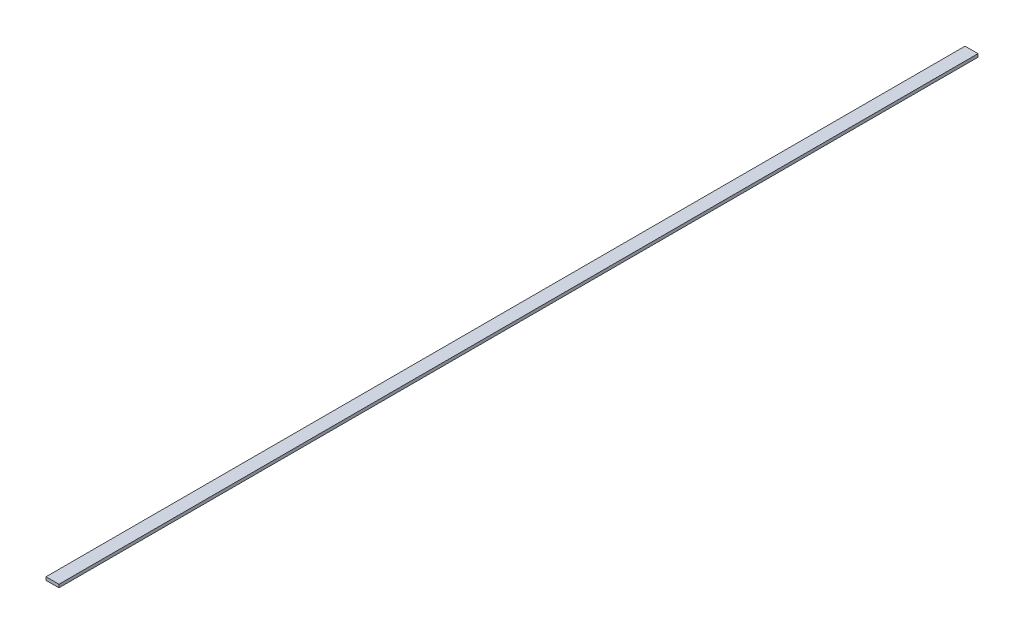
ISO-10303-21;
HEADER;
FILE_DESCRIPTION(('STEP AP214'),'2;1');
FILE_NAME('part.step','',(''),(''),'','','');
FILE_SCHEMA(('AUTOMOTIVE_DESIGN { 1 0 10303 214 1 1 1 1 }'));
ENDSEC;
DATA;
#1=APPLICATION_CONTEXT('core data for automotive mechanical design processes');
#2=APPLICATION_PROTOCOL_DEFINITION('international standard','automotive_design',2000,#1);
#3=PRODUCT_CONTEXT('',#1,'mechanical');
#4=PRODUCT('Part','Part','',(#3));
#5=PRODUCT_RELATED_PRODUCT_CATEGORY('part','',(#4));
#6=PRODUCT_DEFINITION_FORMATION('','',#4);
#7=PRODUCT_DEFINITION_CONTEXT('part definition',#1,'design');
#8=PRODUCT_DEFINITION('design','',#6,#7);
#9=PRODUCT_DEFINITION_SHAPE('','',#8);
#10=(LENGTH_UNIT() NAMED_UNIT(*) SI_UNIT(.MILLI.,.METRE.));
#11=(NAMED_UNIT(*) PLANE_ANGLE_UNIT() SI_UNIT($,.RADIAN.));
#12=(NAMED_UNIT(*) SI_UNIT($,.STERADIAN.) SOLID_ANGLE_UNIT());
#13=UNCERTAINTY_MEASURE_WITH_UNIT(LENGTH_MEASURE(1.E-05),#10,'distance_accuracy_value','');
#14=(GEOMETRIC_REPRESENTATION_CONTEXT(3) GLOBAL_UNCERTAINTY_ASSIGNED_CONTEXT((#13)) GLOBAL_UNIT_ASSIGNED_CONTEXT((#10,
#11,#12)) REPRESENTATION_CONTEXT('',''));
#15=CARTESIAN_POINT('',(0.,0.,0.));
#16=DIRECTION('',(0.,0.,1.));
#17=DIRECTION('',(1.,0.,0.));
#18=AXIS2_PLACEMENT_3D('',#15,#16,#17);
#19=CARTESIAN_POINT('',(0.,1.5,0.));
#20=DIRECTION('',(1.,0.,0.));
#21=DIRECTION('',(0.,0.,-1.));
#22=AXIS2_PLACEMENT_3D('',#19,#20,#21);
#23=PLANE('',#22);
#24=DIRECTION('',(0.,0.,1.));
#25=VECTOR('',#24,1.);
#26=CARTESIAN_POINT('',(0.,0.,0.));
#27=LINE('',#26,#25);
#28=CARTESIAN_POINT('',(0.,0.,-440.));
#29=VERTEX_POINT('',#28);
#30=CARTESIAN_POINT('',(0.,0.,0.));
#31=VERTEX_POINT('',#30);
#32=EDGE_CURVE('E96',#29,#31,#27,.T.);
#33=ORIENTED_EDGE('',*,*,#32,.T.);
#34=DIRECTION('',(0.,-1.,0.));
#35=VECTOR('',#34,1.);
#36=CARTESIAN_POINT('',(0.,1.5,0.));
#37=LINE('',#36,#35);
#38=CARTESIAN_POINT('',(0.,1.5,0.));
#39=VERTEX_POINT('',#38);
#40=EDGE_CURVE('E11',#39,#31,#37,.T.);
#41=ORIENTED_EDGE('',*,*,#40,.F.);
#42=DIRECTION('',(0.,0.,1.));
#43=VECTOR('',#42,1.);
#44=CARTESIAN_POINT('',(0.,1.5,0.));
#45=LINE('',#44,#43);
#46=CARTESIAN_POINT('',(0.,1.5,-440.));
#47=VERTEX_POINT('',#46);
#48=EDGE_CURVE('E84',#47,#39,#45,.T.);
#49=ORIENTED_EDGE('',*,*,#48,.F.);
#50=DIRECTION('',(0.,-1.,0.));
#51=VECTOR('',#50,1.);
#52=CARTESIAN_POINT('',(0.,1.5,-440.));
#53=LINE('',#52,#51);
#54=EDGE_CURVE('E92',#47,#29,#53,.T.);
#55=ORIENTED_EDGE('',*,*,#54,.T.);
#56=EDGE_LOOP('',(#33,#41,#49,#55));
#57=FACE_BOUND('',#56,.T.);
#58=ADVANCED_FACE('F33',(#57),#23,.F.);
#59=CARTESIAN_POINT('',(0.,1.5,0.));
#60=DIRECTION('',(0.,0.,-1.));
#61=DIRECTION('',(-1.,0.,0.));
#62=AXIS2_PLACEMENT_3D('',#59,#60,#61);
#63=PLANE('',#62);
#64=DIRECTION('',(1.,0.,0.));
#65=VECTOR('',#64,1.);
#66=CARTESIAN_POINT('',(0.,0.,0.));
#67=LINE('',#66,#65);
#68=CARTESIAN_POINT('',(6.2,0.,0.));
#69=VERTEX_POINT('',#68);
#70=EDGE_CURVE('E88',#31,#69,#67,.T.);
#71=ORIENTED_EDGE('',*,*,#70,.T.);
#72=DIRECTION('',(0.,-1.,0.));
#73=VECTOR('',#72,1.);
#74=CARTESIAN_POINT('',(6.2,1.5,0.));
#75=LINE('',#74,#73);
#76=CARTESIAN_POINT('',(6.2,1.5,0.));
#77=VERTEX_POINT('',#76);
#78=EDGE_CURVE('E41',#77,#69,#75,.T.);
#79=ORIENTED_EDGE('',*,*,#78,.F.);
#80=DIRECTION('',(1.,0.,0.));
#81=VECTOR('',#80,1.);
#82=CARTESIAN_POINT('',(0.,1.5,0.));
#83=LINE('',#82,#81);
#84=EDGE_CURVE('E79',#39,#77,#83,.T.);
#85=ORIENTED_EDGE('',*,*,#84,.F.);
#86=ORIENTED_EDGE('',*,*,#40,.T.);
#87=EDGE_LOOP('',(#71,#79,#85,#86));
#88=FACE_BOUND('',#87,.T.);
#89=ADVANCED_FACE('F87',(#88),#63,.F.);
#90=CARTESIAN_POINT('',(6.2,1.5,0.));
#91=DIRECTION('',(-1.,0.,0.));
#92=DIRECTION('',(0.,0.,1.));
#93=AXIS2_PLACEMENT_3D('',#90,#91,#92);
#94=PLANE('',#93);
#95=DIRECTION('',(0.,0.,-1.));
#96=VECTOR('',#95,1.);
#97=CARTESIAN_POINT('',(6.2,0.,0.));
#98=LINE('',#97,#96);
#99=CARTESIAN_POINT('',(6.2,0.,-440.));
#100=VERTEX_POINT('',#99);
#101=EDGE_CURVE('E66',#69,#100,#98,.T.);
#102=ORIENTED_EDGE('',*,*,#101,.T.);
#103=DIRECTION('',(0.,-1.,0.));
#104=VECTOR('',#103,1.);
#105=CARTESIAN_POINT('',(6.2,1.5,-440.));
#106=LINE('',#105,#104);
#107=CARTESIAN_POINT('',(6.2,1.5,-440.));
#108=VERTEX_POINT('',#107);
#109=EDGE_CURVE('E89',#108,#100,#106,.T.);
#110=ORIENTED_EDGE('',*,*,#109,.F.);
#111=DIRECTION('',(0.,0.,-1.));
#112=VECTOR('',#111,1.);
#113=CARTESIAN_POINT('',(6.2,1.5,0.));
#114=LINE('',#113,#112);
#115=EDGE_CURVE('E82',#77,#108,#114,.T.);
#116=ORIENTED_EDGE('',*,*,#115,.F.);
#117=ORIENTED_EDGE('',*,*,#78,.T.);
#118=EDGE_LOOP('',(#102,#110,#116,#117));
#119=FACE_BOUND('',#118,.T.);
#120=ADVANCED_FACE('F90',(#119),#94,.F.);
#121=CARTESIAN_POINT('',(0.,1.5,-440.));
#122=DIRECTION('',(0.,0.,1.));
#123=DIRECTION('',(1.,0.,0.));
#124=AXIS2_PLACEMENT_3D('',#121,#122,#123);
#125=PLANE('',#124);
#126=DIRECTION('',(-1.,0.,0.));
#127=VECTOR('',#126,1.);
#128=CARTESIAN_POINT('',(0.,0.,-440.));
#129=LINE('',#128,#127);
#130=EDGE_CURVE('E72',#100,#29,#129,.T.);
#131=ORIENTED_EDGE('',*,*,#130,.T.);
#132=ORIENTED_EDGE('',*,*,#54,.F.);
#133=DIRECTION('',(-1.,0.,0.));
#134=VECTOR('',#133,1.);
#135=CARTESIAN_POINT('',(0.,1.5,-440.));
#136=LINE('',#135,#134);
#137=EDGE_CURVE('E49',#108,#47,#136,.T.);
#138=ORIENTED_EDGE('',*,*,#137,.F.);
#139=ORIENTED_EDGE('',*,*,#109,.T.);
#140=EDGE_LOOP('',(#131,#132,#138,#139));
#141=FACE_BOUND('',#140,.T.);
#142=ADVANCED_FACE('F103',(#141),#125,.F.);
#143=CARTESIAN_POINT('',(0.,1.5,0.));
#144=DIRECTION('',(0.,-1.,0.));
#145=DIRECTION('',(0.,0.,-1.));
#146=AXIS2_PLACEMENT_3D('',#143,#144,#145);
#147=PLANE('',#146);
#148=ORIENTED_EDGE('',*,*,#48,.T.);
#149=ORIENTED_EDGE('',*,*,#84,.T.);
#150=ORIENTED_EDGE('',*,*,#115,.T.);
#151=ORIENTED_EDGE('',*,*,#137,.T.);
#152=EDGE_LOOP('',(#148,#149,#150,#151));
#153=FACE_BOUND('',#152,.T.);
#154=ADVANCED_FACE('F80',(#153),#147,.F.);
#155=CARTESIAN_POINT('',(0.,0.,0.));
#156=DIRECTION('',(0.,-1.,0.));
#157=DIRECTION('',(0.,0.,-1.));
#158=AXIS2_PLACEMENT_3D('',#155,#156,#157);
#159=PLANE('',#158);
#160=ORIENTED_EDGE('',*,*,#32,.F.);
#161=ORIENTED_EDGE('',*,*,#130,.F.);
#162=ORIENTED_EDGE('',*,*,#101,.F.);
#163=ORIENTED_EDGE('',*,*,#70,.F.);
#164=EDGE_LOOP('',(#160,#161,#162,#163));
#165=FACE_BOUND('',#164,.T.);
#166=ADVANCED_FACE('F106',(#165),#159,.T.);
#167=CLOSED_SHELL('',(#58,#89,#120,#142,#154,#166));
#168=MANIFOLD_SOLID_BREP('B2',#167);
#169=ADVANCED_BREP_SHAPE_REPRESENTATION('',(#18,#168),#14);
#170=SHAPE_DEFINITION_REPRESENTATION(#9,#169);
ENDSEC;
END-ISO-10303-21;
